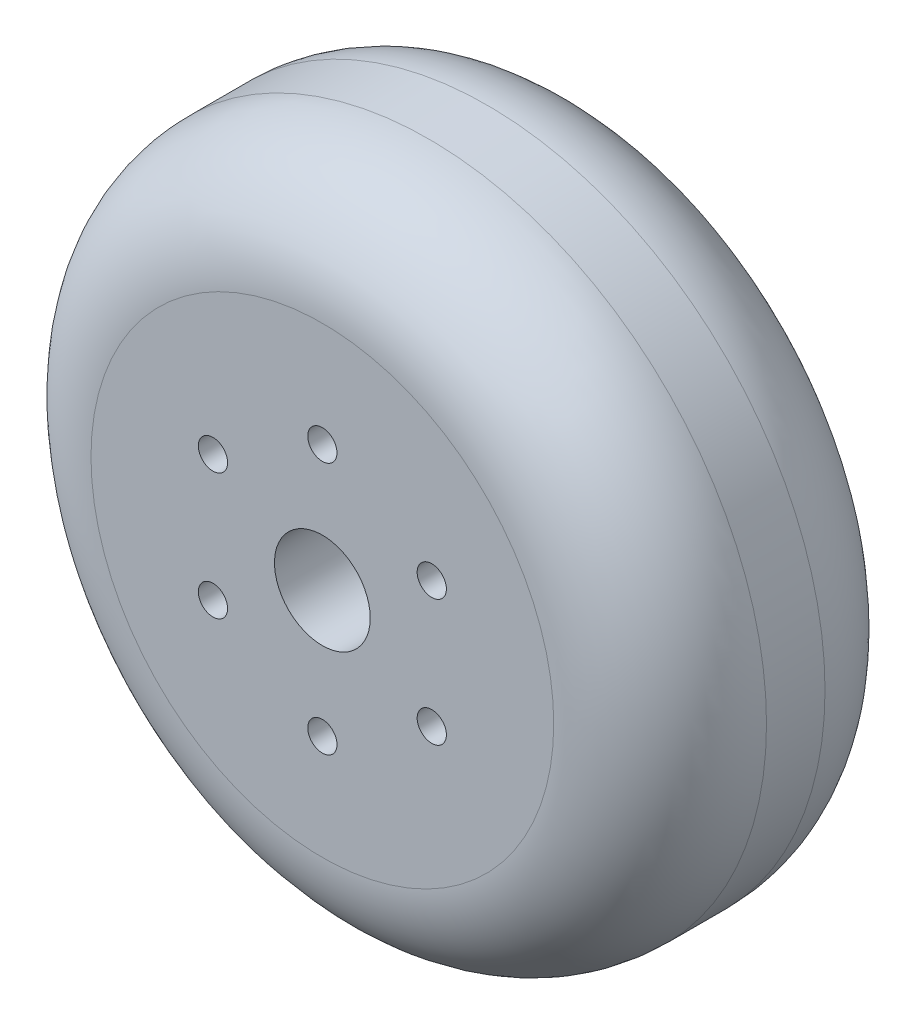
ISO-10303-21;
HEADER;
FILE_DESCRIPTION(('STEP AP214'),'2;1');
FILE_NAME('part.step','',(''),(''),'','','');
FILE_SCHEMA(('AUTOMOTIVE_DESIGN { 1 0 10303 214 1 1 1 1 }'));
ENDSEC;
DATA;
#1=APPLICATION_CONTEXT('core data for automotive mechanical design processes');
#2=APPLICATION_PROTOCOL_DEFINITION('international standard','automotive_design',2000,#1);
#3=PRODUCT_CONTEXT('',#1,'mechanical');
#4=PRODUCT('Part','Part','',(#3));
#5=PRODUCT_RELATED_PRODUCT_CATEGORY('part','',(#4));
#6=PRODUCT_DEFINITION_FORMATION('','',#4);
#7=PRODUCT_DEFINITION_CONTEXT('part definition',#1,'design');
#8=PRODUCT_DEFINITION('design','',#6,#7);
#9=PRODUCT_DEFINITION_SHAPE('','',#8);
#10=(LENGTH_UNIT() NAMED_UNIT(*) SI_UNIT(.MILLI.,.METRE.));
#11=(NAMED_UNIT(*) PLANE_ANGLE_UNIT() SI_UNIT($,.RADIAN.));
#12=(NAMED_UNIT(*) SI_UNIT($,.STERADIAN.) SOLID_ANGLE_UNIT());
#13=UNCERTAINTY_MEASURE_WITH_UNIT(LENGTH_MEASURE(1.E-05),#10,'distance_accuracy_value','');
#14=(GEOMETRIC_REPRESENTATION_CONTEXT(3) GLOBAL_UNCERTAINTY_ASSIGNED_CONTEXT((#13)) GLOBAL_UNIT_ASSIGNED_CONTEXT((#10,
#11,#12)) REPRESENTATION_CONTEXT('',''));
#15=CARTESIAN_POINT('',(0.,0.,0.));
#16=DIRECTION('',(0.,0.,1.));
#17=DIRECTION('',(1.,0.,0.));
#18=AXIS2_PLACEMENT_3D('',#15,#16,#17);
#19=CARTESIAN_POINT('',(0.,0.,51.));
#20=DIRECTION('',(0.,0.,1.));
#21=DIRECTION('',(1.,0.,0.));
#22=AXIS2_PLACEMENT_3D('',#19,#20,#21);
#23=PLANE('',#22);
#24=CARTESIAN_POINT('',(0.,23.75,51.));
#25=DIRECTION('',(0.,0.,1.));
#26=DIRECTION('',(1.,0.,0.));
#27=AXIS2_PLACEMENT_3D('',#24,#25,#26);
#28=CIRCLE('',#27,2.74999999999999);
#29=CARTESIAN_POINT('',(2.74999999999999,23.75,51.));
#30=VERTEX_POINT('',#29);
#31=EDGE_CURVE('E92',#30,#30,#28,.T.);
#32=ORIENTED_EDGE('',*,*,#31,.F.);
#33=EDGE_LOOP('',(#32));
#34=FACE_BOUND('',#33,.T.);
#35=CARTESIAN_POINT('',(20.5681033398814,11.8750000000018,51.));
#36=DIRECTION('',(0.,0.,1.));
#37=DIRECTION('',(1.,0.,0.));
#38=AXIS2_PLACEMENT_3D('',#35,#36,#37);
#39=CIRCLE('',#38,2.74999999999999);
#40=CARTESIAN_POINT('',(23.3181033398814,11.8750000000018,51.));
#41=VERTEX_POINT('',#40);
#42=EDGE_CURVE('E86',#41,#41,#39,.T.);
#43=ORIENTED_EDGE('',*,*,#42,.F.);
#44=EDGE_LOOP('',(#43));
#45=FACE_BOUND('',#44,.T.);
#46=CARTESIAN_POINT('',(20.5681033398835,-11.8749999999982,51.));
#47=DIRECTION('',(0.,0.,1.));
#48=DIRECTION('',(1.,0.,0.));
#49=AXIS2_PLACEMENT_3D('',#46,#47,#48);
#50=CIRCLE('',#49,2.74999999999999);
#51=CARTESIAN_POINT('',(23.3181033398834,-11.8749999999982,51.));
#52=VERTEX_POINT('',#51);
#53=EDGE_CURVE('E80',#52,#52,#50,.T.);
#54=ORIENTED_EDGE('',*,*,#53,.F.);
#55=EDGE_LOOP('',(#54));
#56=FACE_BOUND('',#55,.T.);
#57=CARTESIAN_POINT('',(4.04427652153662E-12,-23.75,51.));
#58=DIRECTION('',(0.,0.,1.));
#59=DIRECTION('',(1.,0.,0.));
#60=AXIS2_PLACEMENT_3D('',#57,#58,#59);
#61=CIRCLE('',#60,2.74999999999999);
#62=CARTESIAN_POINT('',(2.75000000000403,-23.75,51.));
#63=VERTEX_POINT('',#62);
#64=EDGE_CURVE('E74',#63,#63,#61,.T.);
#65=ORIENTED_EDGE('',*,*,#64,.F.);
#66=EDGE_LOOP('',(#65));
#67=FACE_BOUND('',#66,.T.);
#68=CARTESIAN_POINT('',(-20.5681033398774,-11.8750000000018,51.));
#69=DIRECTION('',(0.,0.,1.));
#70=DIRECTION('',(1.,0.,0.));
#71=AXIS2_PLACEMENT_3D('',#68,#69,#70);
#72=CIRCLE('',#71,2.74999999999999);
#73=CARTESIAN_POINT('',(-17.8181033398774,-11.8750000000018,51.));
#74=VERTEX_POINT('',#73);
#75=EDGE_CURVE('E68',#74,#74,#72,.T.);
#76=ORIENTED_EDGE('',*,*,#75,.F.);
#77=EDGE_LOOP('',(#76));
#78=FACE_BOUND('',#77,.T.);
#79=CARTESIAN_POINT('',(-20.5681033398794,11.8749999999983,51.));
#80=DIRECTION('',(0.,0.,1.));
#81=DIRECTION('',(1.,0.,0.));
#82=AXIS2_PLACEMENT_3D('',#79,#80,#81);
#83=CIRCLE('',#82,2.74999999999999);
#84=CARTESIAN_POINT('',(-17.8181033398794,11.8749999999983,51.));
#85=VERTEX_POINT('',#84);
#86=EDGE_CURVE('E62',#85,#85,#83,.T.);
#87=ORIENTED_EDGE('',*,*,#86,.F.);
#88=EDGE_LOOP('',(#87));
#89=FACE_BOUND('',#88,.T.);
#90=CARTESIAN_POINT('',(0.,0.,51.));
#91=DIRECTION('',(0.,0.,1.));
#92=DIRECTION('',(1.,0.,0.));
#93=AXIS2_PLACEMENT_3D('',#90,#91,#92);
#94=CIRCLE('',#93,43.5);
#95=CARTESIAN_POINT('',(43.5,0.,51.));
#96=VERTEX_POINT('',#95);
#97=EDGE_CURVE('E10',#96,#96,#94,.T.);
#98=ORIENTED_EDGE('',*,*,#97,.T.);
#99=EDGE_LOOP('',(#98));
#100=FACE_BOUND('',#99,.T.);
#101=CARTESIAN_POINT('',(0.,0.,51.));
#102=DIRECTION('',(0.,0.,1.));
#103=DIRECTION('',(1.,0.,0.));
#104=AXIS2_PLACEMENT_3D('',#101,#102,#103);
#105=CIRCLE('',#104,9.);
#106=CARTESIAN_POINT('',(9.,0.,51.));
#107=VERTEX_POINT('',#106);
#108=EDGE_CURVE('E53',#107,#107,#105,.T.);
#109=ORIENTED_EDGE('',*,*,#108,.F.);
#110=EDGE_LOOP('',(#109));
#111=FACE_BOUND('',#110,.T.);
#112=ADVANCED_FACE('F33',(#34,#45,#56,#67,#78,#89,#100,#111),#23,.T.);
#113=CARTESIAN_POINT('',(0.,0.,0.));
#114=DIRECTION('',(0.,0.,1.));
#115=DIRECTION('',(1.,0.,0.));
#116=AXIS2_PLACEMENT_3D('',#113,#114,#115);
#117=PLANE('',#116);
#118=CARTESIAN_POINT('',(0.,23.75,0.));
#119=DIRECTION('',(0.,0.,1.));
#120=DIRECTION('',(1.,0.,0.));
#121=AXIS2_PLACEMENT_3D('',#118,#119,#120);
#122=CIRCLE('',#121,2.74999999999999);
#123=CARTESIAN_POINT('',(2.74999999999999,23.75,0.));
#124=VERTEX_POINT('',#123);
#125=EDGE_CURVE('E89',#124,#124,#122,.T.);
#126=ORIENTED_EDGE('',*,*,#125,.T.);
#127=EDGE_LOOP('',(#126));
#128=FACE_BOUND('',#127,.T.);
#129=CARTESIAN_POINT('',(20.5681033398814,11.8750000000018,0.));
#130=DIRECTION('',(0.,0.,1.));
#131=DIRECTION('',(1.,0.,0.));
#132=AXIS2_PLACEMENT_3D('',#129,#130,#131);
#133=CIRCLE('',#132,2.74999999999999);
#134=CARTESIAN_POINT('',(23.3181033398814,11.8750000000018,0.));
#135=VERTEX_POINT('',#134);
#136=EDGE_CURVE('E83',#135,#135,#133,.T.);
#137=ORIENTED_EDGE('',*,*,#136,.T.);
#138=EDGE_LOOP('',(#137));
#139=FACE_BOUND('',#138,.T.);
#140=CARTESIAN_POINT('',(20.5681033398835,-11.8749999999982,0.));
#141=DIRECTION('',(0.,0.,1.));
#142=DIRECTION('',(1.,0.,0.));
#143=AXIS2_PLACEMENT_3D('',#140,#141,#142);
#144=CIRCLE('',#143,2.74999999999999);
#145=CARTESIAN_POINT('',(23.3181033398834,-11.8749999999982,0.));
#146=VERTEX_POINT('',#145);
#147=EDGE_CURVE('E77',#146,#146,#144,.T.);
#148=ORIENTED_EDGE('',*,*,#147,.T.);
#149=EDGE_LOOP('',(#148));
#150=FACE_BOUND('',#149,.T.);
#151=CARTESIAN_POINT('',(4.04427652153662E-12,-23.75,0.));
#152=DIRECTION('',(0.,0.,1.));
#153=DIRECTION('',(1.,0.,0.));
#154=AXIS2_PLACEMENT_3D('',#151,#152,#153);
#155=CIRCLE('',#154,2.74999999999999);
#156=CARTESIAN_POINT('',(2.75000000000404,-23.75,0.));
#157=VERTEX_POINT('',#156);
#158=EDGE_CURVE('E71',#157,#157,#155,.T.);
#159=ORIENTED_EDGE('',*,*,#158,.T.);
#160=EDGE_LOOP('',(#159));
#161=FACE_BOUND('',#160,.T.);
#162=CARTESIAN_POINT('',(-20.5681033398774,-11.8750000000018,0.));
#163=DIRECTION('',(0.,0.,1.));
#164=DIRECTION('',(1.,0.,0.));
#165=AXIS2_PLACEMENT_3D('',#162,#163,#164);
#166=CIRCLE('',#165,2.74999999999999);
#167=CARTESIAN_POINT('',(-17.8181033398774,-11.8750000000018,0.));
#168=VERTEX_POINT('',#167);
#169=EDGE_CURVE('E65',#168,#168,#166,.T.);
#170=ORIENTED_EDGE('',*,*,#169,.T.);
#171=EDGE_LOOP('',(#170));
#172=FACE_BOUND('',#171,.T.);
#173=CARTESIAN_POINT('',(-20.5681033398794,11.8749999999983,0.));
#174=DIRECTION('',(0.,0.,1.));
#175=DIRECTION('',(1.,0.,0.));
#176=AXIS2_PLACEMENT_3D('',#173,#174,#175);
#177=CIRCLE('',#176,2.74999999999999);
#178=CARTESIAN_POINT('',(-17.8181033398794,11.8749999999983,0.));
#179=VERTEX_POINT('',#178);
#180=EDGE_CURVE('E57',#179,#179,#177,.T.);
#181=ORIENTED_EDGE('',*,*,#180,.T.);
#182=EDGE_LOOP('',(#181));
#183=FACE_BOUND('',#182,.T.);
#184=CARTESIAN_POINT('',(0.,0.,0.));
#185=DIRECTION('',(0.,0.,1.));
#186=DIRECTION('',(1.,0.,0.));
#187=AXIS2_PLACEMENT_3D('',#184,#185,#186);
#188=CIRCLE('',#187,43.5);
#189=CARTESIAN_POINT('',(43.5,0.,0.));
#190=VERTEX_POINT('',#189);
#191=EDGE_CURVE('E40',#190,#190,#188,.F.);
#192=ORIENTED_EDGE('',*,*,#191,.T.);
#193=EDGE_LOOP('',(#192));
#194=FACE_BOUND('',#193,.T.);
#195=CARTESIAN_POINT('',(0.,0.,0.));
#196=DIRECTION('',(0.,0.,1.));
#197=DIRECTION('',(1.,0.,0.));
#198=AXIS2_PLACEMENT_3D('',#195,#196,#197);
#199=CIRCLE('',#198,9.);
#200=CARTESIAN_POINT('',(9.,0.,0.));
#201=VERTEX_POINT('',#200);
#202=EDGE_CURVE('E54',#201,#201,#199,.T.);
#203=ORIENTED_EDGE('',*,*,#202,.T.);
#204=EDGE_LOOP('',(#203));
#205=FACE_BOUND('',#204,.T.);
#206=ADVANCED_FACE('F100',(#128,#139,#150,#161,#172,#183,#194,#205),#117,.F.);
#207=CARTESIAN_POINT('',(0.,0.,51.));
#208=DIRECTION('',(0.,0.,-1.));
#209=DIRECTION('',(-1.,0.,0.));
#210=AXIS2_PLACEMENT_3D('',#207,#208,#209);
#211=CYLINDRICAL_SURFACE('',#210,63.5);
#212=CARTESIAN_POINT('',(0.,0.,20.));
#213=DIRECTION('',(0.,0.,1.));
#214=DIRECTION('',(1.,0.,0.));
#215=AXIS2_PLACEMENT_3D('',#212,#213,#214);
#216=CIRCLE('',#215,63.5);
#217=CARTESIAN_POINT('',(63.5,0.,20.));
#218=VERTEX_POINT('',#217);
#219=EDGE_CURVE('E44',#218,#218,#216,.T.);
#220=ORIENTED_EDGE('',*,*,#219,.T.);
#221=EDGE_LOOP('',(#220));
#222=FACE_BOUND('',#221,.T.);
#223=CARTESIAN_POINT('',(0.,0.,31.));
#224=DIRECTION('',(0.,0.,1.));
#225=DIRECTION('',(1.,0.,0.));
#226=AXIS2_PLACEMENT_3D('',#223,#224,#225);
#227=CIRCLE('',#226,63.5);
#228=CARTESIAN_POINT('',(63.5,0.,31.));
#229=VERTEX_POINT('',#228);
#230=EDGE_CURVE('E48',#229,#229,#227,.F.);
#231=ORIENTED_EDGE('',*,*,#230,.T.);
#232=EDGE_LOOP('',(#231));
#233=FACE_BOUND('',#232,.T.);
#234=ADVANCED_FACE('F118',(#222,#233),#211,.T.);
#235=CARTESIAN_POINT('',(0.,0.,51.));
#236=DIRECTION('',(0.,0.,-1.));
#237=DIRECTION('',(-1.,0.,0.));
#238=AXIS2_PLACEMENT_3D('',#235,#236,#237);
#239=CYLINDRICAL_SURFACE('',#238,9.);
#240=ORIENTED_EDGE('',*,*,#108,.T.);
#241=EDGE_LOOP('',(#240));
#242=FACE_BOUND('',#241,.T.);
#243=ORIENTED_EDGE('',*,*,#202,.F.);
#244=EDGE_LOOP('',(#243));
#245=FACE_BOUND('',#244,.T.);
#246=ADVANCED_FACE('F114',(#242,#245),#239,.F.);
#247=CARTESIAN_POINT('',(0.,0.,20.));
#248=DIRECTION('',(0.,0.,1.));
#249=DIRECTION('',(1.,0.,0.));
#250=AXIS2_PLACEMENT_3D('',#247,#248,#249);
#251=TOROIDAL_SURFACE('',#250,43.5,20.);
#252=ORIENTED_EDGE('',*,*,#191,.F.);
#253=EDGE_LOOP('',(#252));
#254=FACE_BOUND('',#253,.T.);
#255=ORIENTED_EDGE('',*,*,#219,.F.);
#256=EDGE_LOOP('',(#255));
#257=FACE_BOUND('',#256,.T.);
#258=ADVANCED_FACE('F117',(#254,#257),#251,.T.);
#259=CARTESIAN_POINT('',(0.,0.,31.));
#260=DIRECTION('',(0.,0.,1.));
#261=DIRECTION('',(1.,0.,0.));
#262=AXIS2_PLACEMENT_3D('',#259,#260,#261);
#263=TOROIDAL_SURFACE('',#262,43.5,20.);
#264=ORIENTED_EDGE('',*,*,#230,.F.);
#265=EDGE_LOOP('',(#264));
#266=FACE_BOUND('',#265,.T.);
#267=ORIENTED_EDGE('',*,*,#97,.F.);
#268=EDGE_LOOP('',(#267));
#269=FACE_BOUND('',#268,.T.);
#270=ADVANCED_FACE('F35',(#266,#269),#263,.T.);
#271=CARTESIAN_POINT('',(-20.5681033398794,11.8749999999983,51.));
#272=DIRECTION('',(0.,0.,1.));
#273=DIRECTION('',(1.,0.,0.));
#274=AXIS2_PLACEMENT_3D('',#271,#272,#273);
#275=CYLINDRICAL_SURFACE('',#274,2.74999999999999);
#276=ORIENTED_EDGE('',*,*,#180,.F.);
#277=EDGE_LOOP('',(#276));
#278=FACE_BOUND('',#277,.T.);
#279=ORIENTED_EDGE('',*,*,#86,.T.);
#280=EDGE_LOOP('',(#279));
#281=FACE_BOUND('',#280,.T.);
#282=ADVANCED_FACE('F136',(#278,#281),#275,.F.);
#283=CARTESIAN_POINT('',(-20.5681033398774,-11.8750000000018,51.));
#284=DIRECTION('',(0.,0.,1.));
#285=DIRECTION('',(1.,0.,0.));
#286=AXIS2_PLACEMENT_3D('',#283,#284,#285);
#287=CYLINDRICAL_SURFACE('',#286,2.74999999999999);
#288=ORIENTED_EDGE('',*,*,#169,.F.);
#289=EDGE_LOOP('',(#288));
#290=FACE_BOUND('',#289,.T.);
#291=ORIENTED_EDGE('',*,*,#75,.T.);
#292=EDGE_LOOP('',(#291));
#293=FACE_BOUND('',#292,.T.);
#294=ADVANCED_FACE('F146',(#290,#293),#287,.F.);
#295=CARTESIAN_POINT('',(4.04427652153662E-12,-23.75,51.));
#296=DIRECTION('',(0.,0.,1.));
#297=DIRECTION('',(1.,0.,0.));
#298=AXIS2_PLACEMENT_3D('',#295,#296,#297);
#299=CYLINDRICAL_SURFACE('',#298,2.74999999999999);
#300=ORIENTED_EDGE('',*,*,#158,.F.);
#301=EDGE_LOOP('',(#300));
#302=FACE_BOUND('',#301,.T.);
#303=ORIENTED_EDGE('',*,*,#64,.T.);
#304=EDGE_LOOP('',(#303));
#305=FACE_BOUND('',#304,.T.);
#306=ADVANCED_FACE('F152',(#302,#305),#299,.F.);
#307=CARTESIAN_POINT('',(20.5681033398835,-11.8749999999982,51.));
#308=DIRECTION('',(0.,0.,1.));
#309=DIRECTION('',(1.,0.,0.));
#310=AXIS2_PLACEMENT_3D('',#307,#308,#309);
#311=CYLINDRICAL_SURFACE('',#310,2.74999999999999);
#312=ORIENTED_EDGE('',*,*,#147,.F.);
#313=EDGE_LOOP('',(#312));
#314=FACE_BOUND('',#313,.T.);
#315=ORIENTED_EDGE('',*,*,#53,.T.);
#316=EDGE_LOOP('',(#315));
#317=FACE_BOUND('',#316,.T.);
#318=ADVANCED_FACE('F160',(#314,#317),#311,.F.);
#319=CARTESIAN_POINT('',(20.5681033398814,11.8750000000018,51.));
#320=DIRECTION('',(0.,0.,1.));
#321=DIRECTION('',(1.,0.,0.));
#322=AXIS2_PLACEMENT_3D('',#319,#320,#321);
#323=CYLINDRICAL_SURFACE('',#322,2.74999999999999);
#324=ORIENTED_EDGE('',*,*,#136,.F.);
#325=EDGE_LOOP('',(#324));
#326=FACE_BOUND('',#325,.T.);
#327=ORIENTED_EDGE('',*,*,#42,.T.);
#328=EDGE_LOOP('',(#327));
#329=FACE_BOUND('',#328,.T.);
#330=ADVANCED_FACE('F164',(#326,#329),#323,.F.);
#331=CARTESIAN_POINT('',(0.,23.75,51.));
#332=DIRECTION('',(0.,0.,1.));
#333=DIRECTION('',(1.,0.,0.));
#334=AXIS2_PLACEMENT_3D('',#331,#332,#333);
#335=CYLINDRICAL_SURFACE('',#334,2.74999999999999);
#336=ORIENTED_EDGE('',*,*,#125,.F.);
#337=EDGE_LOOP('',(#336));
#338=FACE_BOUND('',#337,.T.);
#339=ORIENTED_EDGE('',*,*,#31,.T.);
#340=EDGE_LOOP('',(#339));
#341=FACE_BOUND('',#340,.T.);
#342=ADVANCED_FACE('F96',(#338,#341),#335,.F.);
#343=CLOSED_SHELL('',(#112,#206,#234,#246,#258,#270,#282,#294,#306,#318,#330,#342));
#344=MANIFOLD_SOLID_BREP('B2',#343);
#345=ADVANCED_BREP_SHAPE_REPRESENTATION('',(#18,#344),#14);
#346=SHAPE_DEFINITION_REPRESENTATION(#9,#345);
ENDSEC;
END-ISO-10303-21;
